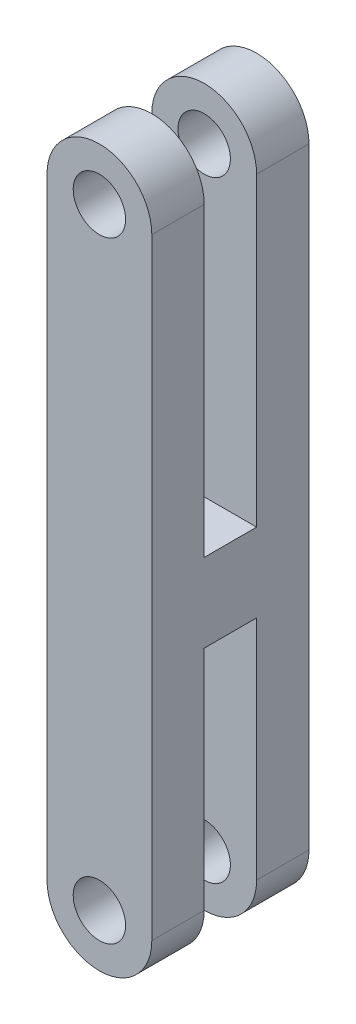
ISO-10303-21;
HEADER;
FILE_DESCRIPTION(('STEP AP214'),'2;1');
FILE_NAME('part.step','',(''),(''),'','','');
FILE_SCHEMA(('AUTOMOTIVE_DESIGN { 1 0 10303 214 1 1 1 1 }'));
ENDSEC;
DATA;
#1=APPLICATION_CONTEXT('core data for automotive mechanical design processes');
#2=APPLICATION_PROTOCOL_DEFINITION('international standard','automotive_design',2000,#1);
#3=PRODUCT_CONTEXT('',#1,'mechanical');
#4=PRODUCT('Part','Part','',(#3));
#5=PRODUCT_RELATED_PRODUCT_CATEGORY('part','',(#4));
#6=PRODUCT_DEFINITION_FORMATION('','',#4);
#7=PRODUCT_DEFINITION_CONTEXT('part definition',#1,'design');
#8=PRODUCT_DEFINITION('design','',#6,#7);
#9=PRODUCT_DEFINITION_SHAPE('','',#8);
#10=(LENGTH_UNIT() NAMED_UNIT(*) SI_UNIT(.MILLI.,.METRE.));
#11=(NAMED_UNIT(*) PLANE_ANGLE_UNIT() SI_UNIT($,.RADIAN.));
#12=(NAMED_UNIT(*) SI_UNIT($,.STERADIAN.) SOLID_ANGLE_UNIT());
#13=UNCERTAINTY_MEASURE_WITH_UNIT(LENGTH_MEASURE(1.E-05),#10,'distance_accuracy_value','');
#14=(GEOMETRIC_REPRESENTATION_CONTEXT(3) GLOBAL_UNCERTAINTY_ASSIGNED_CONTEXT((#13)) GLOBAL_UNIT_ASSIGNED_CONTEXT((#10,
#11,#12)) REPRESENTATION_CONTEXT('',''));
#15=CARTESIAN_POINT('',(0.,0.,0.));
#16=DIRECTION('',(0.,0.,1.));
#17=DIRECTION('',(1.,0.,0.));
#18=AXIS2_PLACEMENT_3D('',#15,#16,#17);
#19=CARTESIAN_POINT('',(0.,0.,9.));
#20=DIRECTION('',(0.,0.,-1.));
#21=DIRECTION('',(-1.,0.,0.));
#22=AXIS2_PLACEMENT_3D('',#19,#20,#21);
#23=CYLINDRICAL_SURFACE('',#22,3.);
#24=CARTESIAN_POINT('',(0.,0.,5.99999999999999));
#25=DIRECTION('',(0.,0.,1.));
#26=DIRECTION('',(0.,-1.,0.));
#27=AXIS2_PLACEMENT_3D('',#24,#25,#26);
#28=CIRCLE('',#27,3.);
#29=CARTESIAN_POINT('',(-3.,0.,5.99999999999999));
#30=VERTEX_POINT('',#29);
#31=CARTESIAN_POINT('',(3.,0.,5.99999999999999));
#32=VERTEX_POINT('',#31);
#33=EDGE_CURVE('E170',#30,#32,#28,.T.);
#34=ORIENTED_EDGE('',*,*,#33,.T.);
#35=DIRECTION('',(0.,0.,-1.));
#36=VECTOR('',#35,1.);
#37=CARTESIAN_POINT('',(3.,0.,9.));
#38=LINE('',#37,#36);
#39=CARTESIAN_POINT('',(3.,0.,9.));
#40=VERTEX_POINT('',#39);
#41=EDGE_CURVE('E227',#40,#32,#38,.T.);
#42=ORIENTED_EDGE('',*,*,#41,.F.);
#43=CARTESIAN_POINT('',(0.,0.,9.));
#44=DIRECTION('',(0.,0.,1.));
#45=DIRECTION('',(1.,0.,0.));
#46=AXIS2_PLACEMENT_3D('',#43,#44,#45);
#47=CIRCLE('',#46,3.);
#48=CARTESIAN_POINT('',(-3.,0.,9.));
#49=VERTEX_POINT('',#48);
#50=EDGE_CURVE('E195',#49,#40,#47,.T.);
#51=ORIENTED_EDGE('',*,*,#50,.F.);
#52=DIRECTION('',(0.,0.,-1.));
#53=VECTOR('',#52,1.);
#54=CARTESIAN_POINT('',(-3.,0.,9.));
#55=LINE('',#54,#53);
#56=EDGE_CURVE('E216',#49,#30,#55,.T.);
#57=ORIENTED_EDGE('',*,*,#56,.T.);
#58=EDGE_LOOP('',(#34,#42,#51,#57));
#59=FACE_BOUND('',#58,.T.);
#60=ADVANCED_FACE('F35',(#59),#23,.T.);
#61=CARTESIAN_POINT('',(0.,35.,9.));
#62=DIRECTION('',(0.,0.,-1.));
#63=DIRECTION('',(-1.,0.,0.));
#64=AXIS2_PLACEMENT_3D('',#61,#62,#63);
#65=CYLINDRICAL_SURFACE('',#64,3.);
#66=CARTESIAN_POINT('',(0.,35.,3.));
#67=DIRECTION('',(0.,0.,-1.));
#68=DIRECTION('',(0.,1.,0.));
#69=AXIS2_PLACEMENT_3D('',#66,#67,#68);
#70=CIRCLE('',#69,3.);
#71=CARTESIAN_POINT('',(-3.,35.,3.));
#72=VERTEX_POINT('',#71);
#73=CARTESIAN_POINT('',(3.,35.,3.));
#74=VERTEX_POINT('',#73);
#75=EDGE_CURVE('E180',#72,#74,#70,.T.);
#76=ORIENTED_EDGE('',*,*,#75,.T.);
#77=DIRECTION('',(0.,0.,-1.));
#78=VECTOR('',#77,1.);
#79=CARTESIAN_POINT('',(3.,35.,9.));
#80=LINE('',#79,#78);
#81=CARTESIAN_POINT('',(3.,35.,0.));
#82=VERTEX_POINT('',#81);
#83=EDGE_CURVE('E223',#74,#82,#80,.T.);
#84=ORIENTED_EDGE('',*,*,#83,.T.);
#85=CARTESIAN_POINT('',(0.,35.,0.));
#86=DIRECTION('',(0.,0.,1.));
#87=DIRECTION('',(1.,0.,0.));
#88=AXIS2_PLACEMENT_3D('',#85,#86,#87);
#89=CIRCLE('',#88,3.);
#90=CARTESIAN_POINT('',(-3.,35.,0.));
#91=VERTEX_POINT('',#90);
#92=EDGE_CURVE('E211',#82,#91,#89,.T.);
#93=ORIENTED_EDGE('',*,*,#92,.T.);
#94=DIRECTION('',(0.,0.,-1.));
#95=VECTOR('',#94,1.);
#96=CARTESIAN_POINT('',(-3.,35.,9.));
#97=LINE('',#96,#95);
#98=EDGE_CURVE('E219',#72,#91,#97,.T.);
#99=ORIENTED_EDGE('',*,*,#98,.F.);
#100=EDGE_LOOP('',(#76,#84,#93,#99));
#101=FACE_BOUND('',#100,.T.);
#102=ADVANCED_FACE('F263',(#101),#65,.T.);
#103=CARTESIAN_POINT('',(0.,35.,9.));
#104=DIRECTION('',(0.,0.,-1.));
#105=DIRECTION('',(-1.,0.,0.));
#106=AXIS2_PLACEMENT_3D('',#103,#104,#105);
#107=CYLINDRICAL_SURFACE('',#106,1.5);
#108=CARTESIAN_POINT('',(0.,35.,3.));
#109=DIRECTION('',(0.,0.,-1.));
#110=DIRECTION('',(0.,1.,0.));
#111=AXIS2_PLACEMENT_3D('',#108,#109,#110);
#112=CIRCLE('',#111,1.5);
#113=CARTESIAN_POINT('',(0.,36.5,3.));
#114=VERTEX_POINT('',#113);
#115=EDGE_CURVE('E176',#114,#114,#112,.T.);
#116=ORIENTED_EDGE('',*,*,#115,.F.);
#117=EDGE_LOOP('',(#116));
#118=FACE_BOUND('',#117,.T.);
#119=CARTESIAN_POINT('',(0.,35.,0.));
#120=DIRECTION('',(0.,0.,1.));
#121=DIRECTION('',(1.,0.,0.));
#122=AXIS2_PLACEMENT_3D('',#119,#120,#121);
#123=CIRCLE('',#122,1.5);
#124=CARTESIAN_POINT('',(1.5,35.,0.));
#125=VERTEX_POINT('',#124);
#126=EDGE_CURVE('E186',#125,#125,#123,.T.);
#127=ORIENTED_EDGE('',*,*,#126,.F.);
#128=EDGE_LOOP('',(#127));
#129=FACE_BOUND('',#128,.T.);
#130=ADVANCED_FACE('F292',(#118,#129),#107,.F.);
#131=CARTESIAN_POINT('',(0.,0.,9.));
#132=DIRECTION('',(0.,0.,-1.));
#133=DIRECTION('',(-1.,0.,0.));
#134=AXIS2_PLACEMENT_3D('',#131,#132,#133);
#135=CYLINDRICAL_SURFACE('',#134,1.5);
#136=CARTESIAN_POINT('',(0.,0.,5.99999999999999));
#137=DIRECTION('',(0.,0.,1.));
#138=DIRECTION('',(0.,-1.,0.));
#139=AXIS2_PLACEMENT_3D('',#136,#137,#138);
#140=CIRCLE('',#139,1.5);
#141=CARTESIAN_POINT('',(0.,-1.5,5.99999999999999));
#142=VERTEX_POINT('',#141);
#143=EDGE_CURVE('E166',#142,#142,#140,.T.);
#144=ORIENTED_EDGE('',*,*,#143,.F.);
#145=EDGE_LOOP('',(#144));
#146=FACE_BOUND('',#145,.T.);
#147=CARTESIAN_POINT('',(0.,0.,9.));
#148=DIRECTION('',(0.,0.,1.));
#149=DIRECTION('',(1.,0.,0.));
#150=AXIS2_PLACEMENT_3D('',#147,#148,#149);
#151=CIRCLE('',#150,1.5);
#152=CARTESIAN_POINT('',(1.5,0.,9.));
#153=VERTEX_POINT('',#152);
#154=EDGE_CURVE('E183',#153,#153,#151,.T.);
#155=ORIENTED_EDGE('',*,*,#154,.T.);
#156=EDGE_LOOP('',(#155));
#157=FACE_BOUND('',#156,.T.);
#158=ADVANCED_FACE('F303',(#146,#157),#135,.F.);
#159=CARTESIAN_POINT('',(0.,0.,9.));
#160=DIRECTION('',(0.,0.,1.));
#161=DIRECTION('',(1.,0.,0.));
#162=AXIS2_PLACEMENT_3D('',#159,#160,#161);
#163=PLANE('',#162);
#164=CARTESIAN_POINT('',(0.,35.,9.));
#165=DIRECTION('',(0.,0.,1.));
#166=DIRECTION('',(1.,0.,0.));
#167=AXIS2_PLACEMENT_3D('',#164,#165,#166);
#168=CIRCLE('',#167,1.5);
#169=CARTESIAN_POINT('',(1.5,35.,9.));
#170=VERTEX_POINT('',#169);
#171=EDGE_CURVE('E189',#170,#170,#168,.T.);
#172=ORIENTED_EDGE('',*,*,#171,.F.);
#173=EDGE_LOOP('',(#172));
#174=FACE_BOUND('',#173,.T.);
#175=ORIENTED_EDGE('',*,*,#50,.T.);
#176=DIRECTION('',(0.,1.,0.));
#177=VECTOR('',#176,1.);
#178=CARTESIAN_POINT('',(3.,0.,9.));
#179=LINE('',#178,#177);
#180=CARTESIAN_POINT('',(3.,35.,9.));
#181=VERTEX_POINT('',#180);
#182=EDGE_CURVE('E198',#40,#181,#179,.T.);
#183=ORIENTED_EDGE('',*,*,#182,.T.);
#184=CARTESIAN_POINT('',(0.,35.,9.));
#185=DIRECTION('',(0.,0.,1.));
#186=DIRECTION('',(1.,0.,0.));
#187=AXIS2_PLACEMENT_3D('',#184,#185,#186);
#188=CIRCLE('',#187,3.);
#189=CARTESIAN_POINT('',(-3.,35.,9.));
#190=VERTEX_POINT('',#189);
#191=EDGE_CURVE('E201',#181,#190,#188,.T.);
#192=ORIENTED_EDGE('',*,*,#191,.T.);
#193=DIRECTION('',(0.,-1.,0.));
#194=VECTOR('',#193,1.);
#195=CARTESIAN_POINT('',(-3.,0.,9.));
#196=LINE('',#195,#194);
#197=EDGE_CURVE('E203',#190,#49,#196,.T.);
#198=ORIENTED_EDGE('',*,*,#197,.T.);
#199=EDGE_LOOP('',(#175,#183,#192,#198));
#200=FACE_BOUND('',#199,.T.);
#201=ORIENTED_EDGE('',*,*,#154,.F.);
#202=EDGE_LOOP('',(#201));
#203=FACE_BOUND('',#202,.T.);
#204=ADVANCED_FACE('F255',(#174,#200,#203),#163,.T.);
#205=CARTESIAN_POINT('',(0.,0.,0.));
#206=DIRECTION('',(0.,0.,1.));
#207=DIRECTION('',(1.,0.,0.));
#208=AXIS2_PLACEMENT_3D('',#205,#206,#207);
#209=PLANE('',#208);
#210=CARTESIAN_POINT('',(0.,0.,0.));
#211=DIRECTION('',(0.,0.,1.));
#212=DIRECTION('',(1.,0.,0.));
#213=AXIS2_PLACEMENT_3D('',#210,#211,#212);
#214=CIRCLE('',#213,3.);
#215=CARTESIAN_POINT('',(-3.,0.,0.));
#216=VERTEX_POINT('',#215);
#217=CARTESIAN_POINT('',(3.,0.,0.));
#218=VERTEX_POINT('',#217);
#219=EDGE_CURVE('E192',#216,#218,#214,.T.);
#220=ORIENTED_EDGE('',*,*,#219,.F.);
#221=DIRECTION('',(0.,-1.,0.));
#222=VECTOR('',#221,1.);
#223=CARTESIAN_POINT('',(-3.,0.,0.));
#224=LINE('',#223,#222);
#225=EDGE_CURVE('E199',#91,#216,#224,.T.);
#226=ORIENTED_EDGE('',*,*,#225,.F.);
#227=ORIENTED_EDGE('',*,*,#92,.F.);
#228=DIRECTION('',(0.,1.,0.));
#229=VECTOR('',#228,1.);
#230=CARTESIAN_POINT('',(3.,0.,0.));
#231=LINE('',#230,#229);
#232=EDGE_CURVE('E208',#218,#82,#231,.T.);
#233=ORIENTED_EDGE('',*,*,#232,.F.);
#234=EDGE_LOOP('',(#220,#226,#227,#233));
#235=FACE_BOUND('',#234,.T.);
#236=ORIENTED_EDGE('',*,*,#126,.T.);
#237=EDGE_LOOP('',(#236));
#238=FACE_BOUND('',#237,.T.);
#239=CARTESIAN_POINT('',(0.,0.,0.));
#240=DIRECTION('',(0.,0.,1.));
#241=DIRECTION('',(1.,0.,0.));
#242=AXIS2_PLACEMENT_3D('',#239,#240,#241);
#243=CIRCLE('',#242,1.5);
#244=CARTESIAN_POINT('',(1.5,0.,0.));
#245=VERTEX_POINT('',#244);
#246=EDGE_CURVE('E182',#245,#245,#243,.T.);
#247=ORIENTED_EDGE('',*,*,#246,.T.);
#248=EDGE_LOOP('',(#247));
#249=FACE_BOUND('',#248,.T.);
#250=ADVANCED_FACE('F269',(#235,#238,#249),#209,.F.);
#251=CARTESIAN_POINT('',(3.,0.,2.99999999999999));
#252=VERTEX_POINT('',#251);
#253=EDGE_CURVE('E226',#252,#218,#38,.T.);
#254=ORIENTED_EDGE('',*,*,#253,.F.);
#255=CARTESIAN_POINT('',(0.,0.,2.99999999999999));
#256=DIRECTION('',(0.,0.,-1.));
#257=DIRECTION('',(0.,1.,0.));
#258=AXIS2_PLACEMENT_3D('',#255,#256,#257);
#259=CIRCLE('',#258,3.);
#260=CARTESIAN_POINT('',(-3.,0.,2.99999999999999));
#261=VERTEX_POINT('',#260);
#262=EDGE_CURVE('E164',#252,#261,#259,.T.);
#263=ORIENTED_EDGE('',*,*,#262,.T.);
#264=EDGE_CURVE('E205',#261,#216,#55,.T.);
#265=ORIENTED_EDGE('',*,*,#264,.T.);
#266=ORIENTED_EDGE('',*,*,#219,.T.);
#267=EDGE_LOOP('',(#254,#263,#265,#266));
#268=FACE_BOUND('',#267,.T.);
#269=ADVANCED_FACE('F37',(#268),#23,.T.);
#270=CARTESIAN_POINT('',(3.,0.,9.));
#271=DIRECTION('',(-1.,0.,0.));
#272=DIRECTION('',(0.,0.,1.));
#273=AXIS2_PLACEMENT_3D('',#270,#271,#272);
#274=PLANE('',#273);
#275=ORIENTED_EDGE('',*,*,#83,.F.);
#276=DIRECTION('',(0.,1.,0.));
#277=VECTOR('',#276,1.);
#278=CARTESIAN_POINT('',(3.,38.,3.));
#279=LINE('',#278,#277);
#280=CARTESIAN_POINT('',(3.,17.5,3.));
#281=VERTEX_POINT('',#280);
#282=EDGE_CURVE('E132',#281,#74,#279,.T.);
#283=ORIENTED_EDGE('',*,*,#282,.F.);
#284=DIRECTION('',(0.,0.,-1.));
#285=VECTOR('',#284,1.);
#286=CARTESIAN_POINT('',(3.,17.5,6.));
#287=LINE('',#286,#285);
#288=CARTESIAN_POINT('',(3.,17.5,6.));
#289=VERTEX_POINT('',#288);
#290=EDGE_CURVE('E128',#289,#281,#287,.T.);
#291=ORIENTED_EDGE('',*,*,#290,.F.);
#292=DIRECTION('',(0.,-1.,0.));
#293=VECTOR('',#292,1.);
#294=CARTESIAN_POINT('',(3.,38.,6.));
#295=LINE('',#294,#293);
#296=CARTESIAN_POINT('',(3.,35.,6.));
#297=VERTEX_POINT('',#296);
#298=EDGE_CURVE('E135',#297,#289,#295,.T.);
#299=ORIENTED_EDGE('',*,*,#298,.F.);
#300=EDGE_CURVE('E224',#181,#297,#80,.T.);
#301=ORIENTED_EDGE('',*,*,#300,.F.);
#302=ORIENTED_EDGE('',*,*,#182,.F.);
#303=ORIENTED_EDGE('',*,*,#41,.T.);
#304=DIRECTION('',(0.,-1.,0.));
#305=VECTOR('',#304,1.);
#306=CARTESIAN_POINT('',(3.,-3.,5.99999999999999));
#307=LINE('',#306,#305);
#308=CARTESIAN_POINT('',(3.,13.,5.99999999999999));
#309=VERTEX_POINT('',#308);
#310=EDGE_CURVE('E156',#309,#32,#307,.T.);
#311=ORIENTED_EDGE('',*,*,#310,.F.);
#312=DIRECTION('',(0.,0.,1.));
#313=VECTOR('',#312,1.);
#314=CARTESIAN_POINT('',(3.,13.,5.99999999999999));
#315=LINE('',#314,#313);
#316=CARTESIAN_POINT('',(3.,13.,3.));
#317=VERTEX_POINT('',#316);
#318=EDGE_CURVE('E153',#317,#309,#315,.T.);
#319=ORIENTED_EDGE('',*,*,#318,.F.);
#320=DIRECTION('',(0.,1.,0.));
#321=VECTOR('',#320,1.);
#322=CARTESIAN_POINT('',(3.,13.,3.));
#323=LINE('',#322,#321);
#324=EDGE_CURVE('E151',#252,#317,#323,.T.);
#325=ORIENTED_EDGE('',*,*,#324,.F.);
#326=ORIENTED_EDGE('',*,*,#253,.T.);
#327=ORIENTED_EDGE('',*,*,#232,.T.);
#328=EDGE_LOOP('',(#275,#283,#291,#299,#301,#302,#303,#311,#319,#325,#326,#327));
#329=FACE_BOUND('',#328,.T.);
#330=ADVANCED_FACE('F144',(#329),#274,.F.);
#331=ORIENTED_EDGE('',*,*,#300,.T.);
#332=CARTESIAN_POINT('',(0.,35.,6.));
#333=DIRECTION('',(0.,0.,1.));
#334=DIRECTION('',(0.,-1.,0.));
#335=AXIS2_PLACEMENT_3D('',#332,#333,#334);
#336=CIRCLE('',#335,3.);
#337=CARTESIAN_POINT('',(-3.,35.,6.));
#338=VERTEX_POINT('',#337);
#339=EDGE_CURVE('E137',#297,#338,#336,.T.);
#340=ORIENTED_EDGE('',*,*,#339,.T.);
#341=EDGE_CURVE('E220',#190,#338,#97,.T.);
#342=ORIENTED_EDGE('',*,*,#341,.F.);
#343=ORIENTED_EDGE('',*,*,#191,.F.);
#344=EDGE_LOOP('',(#331,#340,#342,#343));
#345=FACE_BOUND('',#344,.T.);
#346=ADVANCED_FACE('F259',(#345),#65,.T.);
#347=CARTESIAN_POINT('',(-3.,0.,9.));
#348=DIRECTION('',(1.,0.,0.));
#349=DIRECTION('',(0.,0.,-1.));
#350=AXIS2_PLACEMENT_3D('',#347,#348,#349);
#351=PLANE('',#350);
#352=DIRECTION('',(0.,0.,-1.));
#353=VECTOR('',#352,1.);
#354=CARTESIAN_POINT('',(-3.,17.5,9.));
#355=LINE('',#354,#353);
#356=CARTESIAN_POINT('',(-3.,17.5,6.));
#357=VERTEX_POINT('',#356);
#358=CARTESIAN_POINT('',(-3.,17.5,3.));
#359=VERTEX_POINT('',#358);
#360=EDGE_CURVE('E11',#357,#359,#355,.T.);
#361=ORIENTED_EDGE('',*,*,#360,.T.);
#362=DIRECTION('',(0.,1.,0.));
#363=VECTOR('',#362,1.);
#364=CARTESIAN_POINT('',(-3.,0.,2.99999999999999));
#365=LINE('',#364,#363);
#366=EDGE_CURVE('E177',#359,#72,#365,.T.);
#367=ORIENTED_EDGE('',*,*,#366,.T.);
#368=ORIENTED_EDGE('',*,*,#98,.T.);
#369=ORIENTED_EDGE('',*,*,#225,.T.);
#370=ORIENTED_EDGE('',*,*,#264,.F.);
#371=DIRECTION('',(0.,1.,0.));
#372=VECTOR('',#371,1.);
#373=CARTESIAN_POINT('',(-3.,0.,2.99999999999999));
#374=LINE('',#373,#372);
#375=CARTESIAN_POINT('',(-3.,13.,3.));
#376=VERTEX_POINT('',#375);
#377=EDGE_CURVE('E161',#261,#376,#374,.T.);
#378=ORIENTED_EDGE('',*,*,#377,.T.);
#379=DIRECTION('',(0.,0.,1.));
#380=VECTOR('',#379,1.);
#381=CARTESIAN_POINT('',(-3.,13.,9.));
#382=LINE('',#381,#380);
#383=CARTESIAN_POINT('',(-3.,13.,5.99999999999999));
#384=VERTEX_POINT('',#383);
#385=EDGE_CURVE('E43',#376,#384,#382,.T.);
#386=ORIENTED_EDGE('',*,*,#385,.T.);
#387=DIRECTION('',(0.,-1.,0.));
#388=VECTOR('',#387,1.);
#389=CARTESIAN_POINT('',(-3.,0.,5.99999999999999));
#390=LINE('',#389,#388);
#391=EDGE_CURVE('E167',#384,#30,#390,.T.);
#392=ORIENTED_EDGE('',*,*,#391,.T.);
#393=ORIENTED_EDGE('',*,*,#56,.F.);
#394=ORIENTED_EDGE('',*,*,#197,.F.);
#395=ORIENTED_EDGE('',*,*,#341,.T.);
#396=DIRECTION('',(0.,-1.,0.));
#397=VECTOR('',#396,1.);
#398=CARTESIAN_POINT('',(-3.,0.,5.99999999999999));
#399=LINE('',#398,#397);
#400=EDGE_CURVE('E173',#338,#357,#399,.T.);
#401=ORIENTED_EDGE('',*,*,#400,.T.);
#402=EDGE_LOOP('',(#361,#367,#368,#369,#370,#378,#386,#392,#393,#394,#395,#401));
#403=FACE_BOUND('',#402,.T.);
#404=ADVANCED_FACE('F239',(#403),#351,.F.);
#405=CARTESIAN_POINT('',(0.,35.,6.));
#406=DIRECTION('',(0.,0.,1.));
#407=DIRECTION('',(0.,-1.,0.));
#408=AXIS2_PLACEMENT_3D('',#405,#406,#407);
#409=CIRCLE('',#408,1.5);
#410=CARTESIAN_POINT('',(0.,33.5,6.));
#411=VERTEX_POINT('',#410);
#412=EDGE_CURVE('E172',#411,#411,#409,.T.);
#413=ORIENTED_EDGE('',*,*,#412,.F.);
#414=EDGE_LOOP('',(#413));
#415=FACE_BOUND('',#414,.T.);
#416=ORIENTED_EDGE('',*,*,#171,.T.);
#417=EDGE_LOOP('',(#416));
#418=FACE_BOUND('',#417,.T.);
#419=ADVANCED_FACE('F309',(#415,#418),#107,.F.);
#420=CARTESIAN_POINT('',(0.,0.,2.99999999999999));
#421=DIRECTION('',(0.,0.,-1.));
#422=DIRECTION('',(0.,1.,0.));
#423=AXIS2_PLACEMENT_3D('',#420,#421,#422);
#424=CIRCLE('',#423,1.5);
#425=CARTESIAN_POINT('',(0.,1.5,2.99999999999999));
#426=VERTEX_POINT('',#425);
#427=EDGE_CURVE('E149',#426,#426,#424,.T.);
#428=ORIENTED_EDGE('',*,*,#427,.F.);
#429=EDGE_LOOP('',(#428));
#430=FACE_BOUND('',#429,.T.);
#431=ORIENTED_EDGE('',*,*,#246,.F.);
#432=EDGE_LOOP('',(#431));
#433=FACE_BOUND('',#432,.T.);
#434=ADVANCED_FACE('F325',(#430,#433),#135,.F.);
#435=CARTESIAN_POINT('',(-12.,13.,5.99999999999999));
#436=DIRECTION('',(0.,1.,0.));
#437=DIRECTION('',(0.,0.,1.));
#438=AXIS2_PLACEMENT_3D('',#435,#436,#437);
#439=PLANE('',#438);
#440=DIRECTION('',(1.,0.,0.));
#441=VECTOR('',#440,1.);
#442=CARTESIAN_POINT('',(-12.,13.,3.));
#443=LINE('',#442,#441);
#444=EDGE_CURVE('E58',#376,#317,#443,.T.);
#445=ORIENTED_EDGE('',*,*,#444,.T.);
#446=ORIENTED_EDGE('',*,*,#318,.T.);
#447=DIRECTION('',(1.,0.,0.));
#448=VECTOR('',#447,1.);
#449=CARTESIAN_POINT('',(-12.,13.,5.99999999999999));
#450=LINE('',#449,#448);
#451=EDGE_CURVE('E141',#384,#309,#450,.T.);
#452=ORIENTED_EDGE('',*,*,#451,.F.);
#453=ORIENTED_EDGE('',*,*,#385,.F.);
#454=EDGE_LOOP('',(#445,#446,#452,#453));
#455=FACE_BOUND('',#454,.T.);
#456=ADVANCED_FACE('F244',(#455),#439,.F.);
#457=CARTESIAN_POINT('',(-12.,-3.,5.99999999999999));
#458=DIRECTION('',(0.,0.,1.));
#459=DIRECTION('',(0.,-1.,0.));
#460=AXIS2_PLACEMENT_3D('',#457,#458,#459);
#461=PLANE('',#460);
#462=ORIENTED_EDGE('',*,*,#143,.T.);
#463=EDGE_LOOP('',(#462));
#464=FACE_BOUND('',#463,.T.);
#465=ORIENTED_EDGE('',*,*,#33,.F.);
#466=ORIENTED_EDGE('',*,*,#391,.F.);
#467=ORIENTED_EDGE('',*,*,#451,.T.);
#468=ORIENTED_EDGE('',*,*,#310,.T.);
#469=EDGE_LOOP('',(#465,#466,#467,#468));
#470=FACE_BOUND('',#469,.T.);
#471=ADVANCED_FACE('F248',(#464,#470),#461,.F.);
#472=CARTESIAN_POINT('',(-12.,13.,3.));
#473=DIRECTION('',(0.,0.,-1.));
#474=DIRECTION('',(0.,1.,0.));
#475=AXIS2_PLACEMENT_3D('',#472,#473,#474);
#476=PLANE('',#475);
#477=ORIENTED_EDGE('',*,*,#427,.T.);
#478=EDGE_LOOP('',(#477));
#479=FACE_BOUND('',#478,.T.);
#480=ORIENTED_EDGE('',*,*,#324,.T.);
#481=ORIENTED_EDGE('',*,*,#444,.F.);
#482=ORIENTED_EDGE('',*,*,#377,.F.);
#483=ORIENTED_EDGE('',*,*,#262,.F.);
#484=EDGE_LOOP('',(#480,#481,#482,#483));
#485=FACE_BOUND('',#484,.T.);
#486=ADVANCED_FACE('F274',(#479,#485),#476,.F.);
#487=CARTESIAN_POINT('',(-12.,17.5,6.));
#488=DIRECTION('',(0.,-1.,0.));
#489=DIRECTION('',(0.,0.,-1.));
#490=AXIS2_PLACEMENT_3D('',#487,#488,#489);
#491=PLANE('',#490);
#492=DIRECTION('',(1.,0.,0.));
#493=VECTOR('',#492,1.);
#494=CARTESIAN_POINT('',(-12.,17.5,6.));
#495=LINE('',#494,#493);
#496=EDGE_CURVE('E50',#357,#289,#495,.T.);
#497=ORIENTED_EDGE('',*,*,#496,.T.);
#498=ORIENTED_EDGE('',*,*,#290,.T.);
#499=DIRECTION('',(1.,0.,0.));
#500=VECTOR('',#499,1.);
#501=CARTESIAN_POINT('',(-12.,17.5,3.));
#502=LINE('',#501,#500);
#503=EDGE_CURVE('E131',#359,#281,#502,.T.);
#504=ORIENTED_EDGE('',*,*,#503,.F.);
#505=ORIENTED_EDGE('',*,*,#360,.F.);
#506=EDGE_LOOP('',(#497,#498,#504,#505));
#507=FACE_BOUND('',#506,.T.);
#508=ADVANCED_FACE('F125',(#507),#491,.F.);
#509=CARTESIAN_POINT('',(-12.,38.,3.));
#510=DIRECTION('',(0.,0.,-1.));
#511=DIRECTION('',(0.,1.,0.));
#512=AXIS2_PLACEMENT_3D('',#509,#510,#511);
#513=PLANE('',#512);
#514=ORIENTED_EDGE('',*,*,#115,.T.);
#515=EDGE_LOOP('',(#514));
#516=FACE_BOUND('',#515,.T.);
#517=ORIENTED_EDGE('',*,*,#75,.F.);
#518=ORIENTED_EDGE('',*,*,#366,.F.);
#519=ORIENTED_EDGE('',*,*,#503,.T.);
#520=ORIENTED_EDGE('',*,*,#282,.T.);
#521=EDGE_LOOP('',(#517,#518,#519,#520));
#522=FACE_BOUND('',#521,.T.);
#523=ADVANCED_FACE('F282',(#516,#522),#513,.F.);
#524=CARTESIAN_POINT('',(-12.,38.,6.));
#525=DIRECTION('',(0.,0.,1.));
#526=DIRECTION('',(0.,-1.,0.));
#527=AXIS2_PLACEMENT_3D('',#524,#525,#526);
#528=PLANE('',#527);
#529=ORIENTED_EDGE('',*,*,#412,.T.);
#530=EDGE_LOOP('',(#529));
#531=FACE_BOUND('',#530,.T.);
#532=ORIENTED_EDGE('',*,*,#298,.T.);
#533=ORIENTED_EDGE('',*,*,#496,.F.);
#534=ORIENTED_EDGE('',*,*,#400,.F.);
#535=ORIENTED_EDGE('',*,*,#339,.F.);
#536=EDGE_LOOP('',(#532,#533,#534,#535));
#537=FACE_BOUND('',#536,.T.);
#538=ADVANCED_FACE('F136',(#531,#537),#528,.F.);
#539=CLOSED_SHELL('',(#60,#102,#130,#158,#204,#250,#269,#330,#346,#404,#419,#434,#456,#471,#486,
#508,#523,#538));
#540=MANIFOLD_SOLID_BREP('B2',#539);
#541=ADVANCED_BREP_SHAPE_REPRESENTATION('',(#18,#540),#14);
#542=SHAPE_DEFINITION_REPRESENTATION(#9,#541);
ENDSEC;
END-ISO-10303-21;
